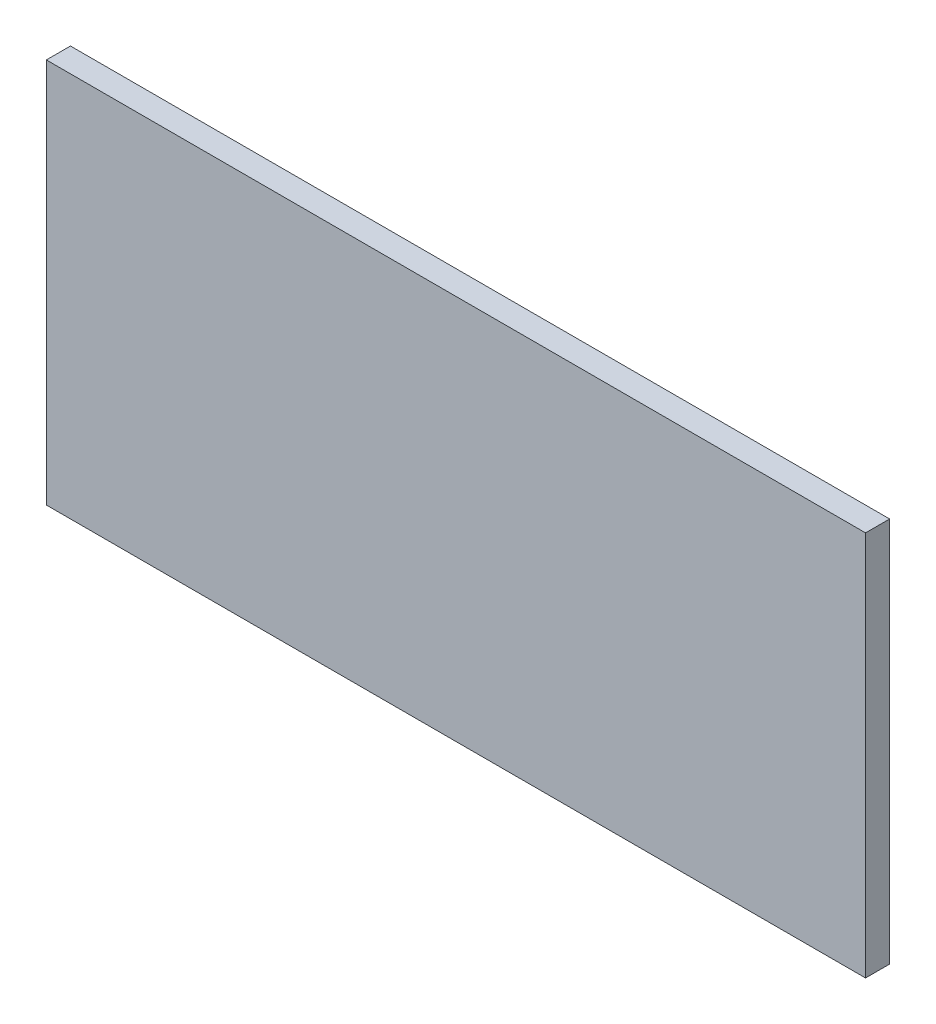
ISO-10303-21;
HEADER;
FILE_DESCRIPTION(('STEP AP214'),'2;1');
FILE_NAME('part.step','',(''),(''),'','','');
FILE_SCHEMA(('AUTOMOTIVE_DESIGN { 1 0 10303 214 1 1 1 1 }'));
ENDSEC;
DATA;
#1=APPLICATION_CONTEXT('core data for automotive mechanical design processes');
#2=APPLICATION_PROTOCOL_DEFINITION('international standard','automotive_design',2000,#1);
#3=PRODUCT_CONTEXT('',#1,'mechanical');
#4=PRODUCT('Part','Part','',(#3));
#5=PRODUCT_RELATED_PRODUCT_CATEGORY('part','',(#4));
#6=PRODUCT_DEFINITION_FORMATION('','',#4);
#7=PRODUCT_DEFINITION_CONTEXT('part definition',#1,'design');
#8=PRODUCT_DEFINITION('design','',#6,#7);
#9=PRODUCT_DEFINITION_SHAPE('','',#8);
#10=(LENGTH_UNIT() NAMED_UNIT(*) SI_UNIT(.MILLI.,.METRE.));
#11=(NAMED_UNIT(*) PLANE_ANGLE_UNIT() SI_UNIT($,.RADIAN.));
#12=(NAMED_UNIT(*) SI_UNIT($,.STERADIAN.) SOLID_ANGLE_UNIT());
#13=UNCERTAINTY_MEASURE_WITH_UNIT(LENGTH_MEASURE(1.E-05),#10,'distance_accuracy_value','');
#14=(GEOMETRIC_REPRESENTATION_CONTEXT(3) GLOBAL_UNCERTAINTY_ASSIGNED_CONTEXT((#13)) GLOBAL_UNIT_ASSIGNED_CONTEXT((#10,
#11,#12)) REPRESENTATION_CONTEXT('',''));
#15=CARTESIAN_POINT('',(0.,0.,0.));
#16=DIRECTION('',(0.,0.,1.));
#17=DIRECTION('',(1.,0.,0.));
#18=AXIS2_PLACEMENT_3D('',#15,#16,#17);
#19=CARTESIAN_POINT('',(53.975,-25.4,3.175));
#20=DIRECTION('',(-1.,0.,0.));
#21=DIRECTION('',(0.,0.,1.));
#22=AXIS2_PLACEMENT_3D('',#19,#20,#21);
#23=PLANE('',#22);
#24=DIRECTION('',(0.,1.,0.));
#25=VECTOR('',#24,1.);
#26=CARTESIAN_POINT('',(53.975,-25.4,0.));
#27=LINE('',#26,#25);
#28=CARTESIAN_POINT('',(53.975,-25.4,0.));
#29=VERTEX_POINT('',#28);
#30=CARTESIAN_POINT('',(53.975,25.4,0.));
#31=VERTEX_POINT('',#30);
#32=EDGE_CURVE('E107',#29,#31,#27,.T.);
#33=ORIENTED_EDGE('',*,*,#32,.T.);
#34=DIRECTION('',(0.,0.,-1.));
#35=VECTOR('',#34,1.);
#36=CARTESIAN_POINT('',(53.975,25.4,3.175));
#37=LINE('',#36,#35);
#38=CARTESIAN_POINT('',(53.975,25.4,3.175));
#39=VERTEX_POINT('',#38);
#40=EDGE_CURVE('E11',#39,#31,#37,.T.);
#41=ORIENTED_EDGE('',*,*,#40,.F.);
#42=DIRECTION('',(0.,1.,0.));
#43=VECTOR('',#42,1.);
#44=CARTESIAN_POINT('',(53.975,-25.4,3.175));
#45=LINE('',#44,#43);
#46=CARTESIAN_POINT('',(53.975,-25.4,3.175));
#47=VERTEX_POINT('',#46);
#48=EDGE_CURVE('E91',#47,#39,#45,.T.);
#49=ORIENTED_EDGE('',*,*,#48,.F.);
#50=DIRECTION('',(0.,0.,-1.));
#51=VECTOR('',#50,1.);
#52=CARTESIAN_POINT('',(53.975,-25.4,3.175));
#53=LINE('',#52,#51);
#54=EDGE_CURVE('E103',#47,#29,#53,.T.);
#55=ORIENTED_EDGE('',*,*,#54,.T.);
#56=EDGE_LOOP('',(#33,#41,#49,#55));
#57=FACE_BOUND('',#56,.T.);
#58=ADVANCED_FACE('F39',(#57),#23,.F.);
#59=CARTESIAN_POINT('',(-53.975,25.4,3.175));
#60=DIRECTION('',(0.,-1.,0.));
#61=DIRECTION('',(0.,0.,-1.));
#62=AXIS2_PLACEMENT_3D('',#59,#60,#61);
#63=PLANE('',#62);
#64=DIRECTION('',(-1.,0.,0.));
#65=VECTOR('',#64,1.);
#66=CARTESIAN_POINT('',(-53.975,25.4,0.));
#67=LINE('',#66,#65);
#68=CARTESIAN_POINT('',(-53.975,25.4,0.));
#69=VERTEX_POINT('',#68);
#70=EDGE_CURVE('E96',#31,#69,#67,.T.);
#71=ORIENTED_EDGE('',*,*,#70,.T.);
#72=DIRECTION('',(0.,0.,-1.));
#73=VECTOR('',#72,1.);
#74=CARTESIAN_POINT('',(-53.975,25.4,3.175));
#75=LINE('',#74,#73);
#76=CARTESIAN_POINT('',(-53.975,25.4,3.175));
#77=VERTEX_POINT('',#76);
#78=EDGE_CURVE('E48',#77,#69,#75,.T.);
#79=ORIENTED_EDGE('',*,*,#78,.F.);
#80=DIRECTION('',(-1.,0.,0.));
#81=VECTOR('',#80,1.);
#82=CARTESIAN_POINT('',(-53.975,25.4,3.175));
#83=LINE('',#82,#81);
#84=EDGE_CURVE('E86',#39,#77,#83,.T.);
#85=ORIENTED_EDGE('',*,*,#84,.F.);
#86=ORIENTED_EDGE('',*,*,#40,.T.);
#87=EDGE_LOOP('',(#71,#79,#85,#86));
#88=FACE_BOUND('',#87,.T.);
#89=ADVANCED_FACE('F95',(#88),#63,.F.);
#90=CARTESIAN_POINT('',(-53.975,-25.4,3.175));
#91=DIRECTION('',(1.,0.,0.));
#92=DIRECTION('',(0.,0.,-1.));
#93=AXIS2_PLACEMENT_3D('',#90,#91,#92);
#94=PLANE('',#93);
#95=DIRECTION('',(0.,-1.,0.));
#96=VECTOR('',#95,1.);
#97=CARTESIAN_POINT('',(-53.975,-25.4,0.));
#98=LINE('',#97,#96);
#99=CARTESIAN_POINT('',(-53.975,-25.4,0.));
#100=VERTEX_POINT('',#99);
#101=EDGE_CURVE('E73',#69,#100,#98,.T.);
#102=ORIENTED_EDGE('',*,*,#101,.T.);
#103=DIRECTION('',(0.,0.,-1.));
#104=VECTOR('',#103,1.);
#105=CARTESIAN_POINT('',(-53.975,-25.4,3.175));
#106=LINE('',#105,#104);
#107=CARTESIAN_POINT('',(-53.975,-25.4,3.175));
#108=VERTEX_POINT('',#107);
#109=EDGE_CURVE('E98',#108,#100,#106,.T.);
#110=ORIENTED_EDGE('',*,*,#109,.F.);
#111=DIRECTION('',(0.,-1.,0.));
#112=VECTOR('',#111,1.);
#113=CARTESIAN_POINT('',(-53.975,-25.4,3.175));
#114=LINE('',#113,#112);
#115=EDGE_CURVE('E89',#77,#108,#114,.T.);
#116=ORIENTED_EDGE('',*,*,#115,.F.);
#117=ORIENTED_EDGE('',*,*,#78,.T.);
#118=EDGE_LOOP('',(#102,#110,#116,#117));
#119=FACE_BOUND('',#118,.T.);
#120=ADVANCED_FACE('F99',(#119),#94,.F.);
#121=CARTESIAN_POINT('',(-53.975,-25.4,3.175));
#122=DIRECTION('',(0.,1.,0.));
#123=DIRECTION('',(0.,0.,1.));
#124=AXIS2_PLACEMENT_3D('',#121,#122,#123);
#125=PLANE('',#124);
#126=DIRECTION('',(1.,0.,0.));
#127=VECTOR('',#126,1.);
#128=CARTESIAN_POINT('',(-53.975,-25.4,0.));
#129=LINE('',#128,#127);
#130=EDGE_CURVE('E79',#100,#29,#129,.T.);
#131=ORIENTED_EDGE('',*,*,#130,.T.);
#132=ORIENTED_EDGE('',*,*,#54,.F.);
#133=DIRECTION('',(1.,0.,0.));
#134=VECTOR('',#133,1.);
#135=CARTESIAN_POINT('',(-53.975,-25.4,3.175));
#136=LINE('',#135,#134);
#137=EDGE_CURVE('E56',#108,#47,#136,.T.);
#138=ORIENTED_EDGE('',*,*,#137,.F.);
#139=ORIENTED_EDGE('',*,*,#109,.T.);
#140=EDGE_LOOP('',(#131,#132,#138,#139));
#141=FACE_BOUND('',#140,.T.);
#142=ADVANCED_FACE('F120',(#141),#125,.F.);
#143=CARTESIAN_POINT('',(0.,0.,3.175));
#144=DIRECTION('',(0.,0.,-1.));
#145=DIRECTION('',(-1.,0.,0.));
#146=AXIS2_PLACEMENT_3D('',#143,#144,#145);
#147=PLANE('',#146);
#148=ORIENTED_EDGE('',*,*,#48,.T.);
#149=ORIENTED_EDGE('',*,*,#84,.T.);
#150=ORIENTED_EDGE('',*,*,#115,.T.);
#151=ORIENTED_EDGE('',*,*,#137,.T.);
#152=EDGE_LOOP('',(#148,#149,#150,#151));
#153=FACE_BOUND('',#152,.T.);
#154=ADVANCED_FACE('F87',(#153),#147,.F.);
#155=CARTESIAN_POINT('',(0.,0.,0.));
#156=DIRECTION('',(0.,0.,-1.));
#157=DIRECTION('',(-1.,0.,0.));
#158=AXIS2_PLACEMENT_3D('',#155,#156,#157);
#159=PLANE('',#158);
#160=ORIENTED_EDGE('',*,*,#32,.F.);
#161=ORIENTED_EDGE('',*,*,#130,.F.);
#162=ORIENTED_EDGE('',*,*,#101,.F.);
#163=ORIENTED_EDGE('',*,*,#70,.F.);
#164=EDGE_LOOP('',(#160,#161,#162,#163));
#165=FACE_BOUND('',#164,.T.);
#166=ADVANCED_FACE('F123',(#165),#159,.T.);
#167=CLOSED_SHELL('',(#58,#89,#120,#142,#154,#166));
#168=MANIFOLD_SOLID_BREP('B2',#167);
#169=ADVANCED_BREP_SHAPE_REPRESENTATION('',(#18,#168),#14);
#170=SHAPE_DEFINITION_REPRESENTATION(#9,#169);
ENDSEC;
END-ISO-10303-21;
